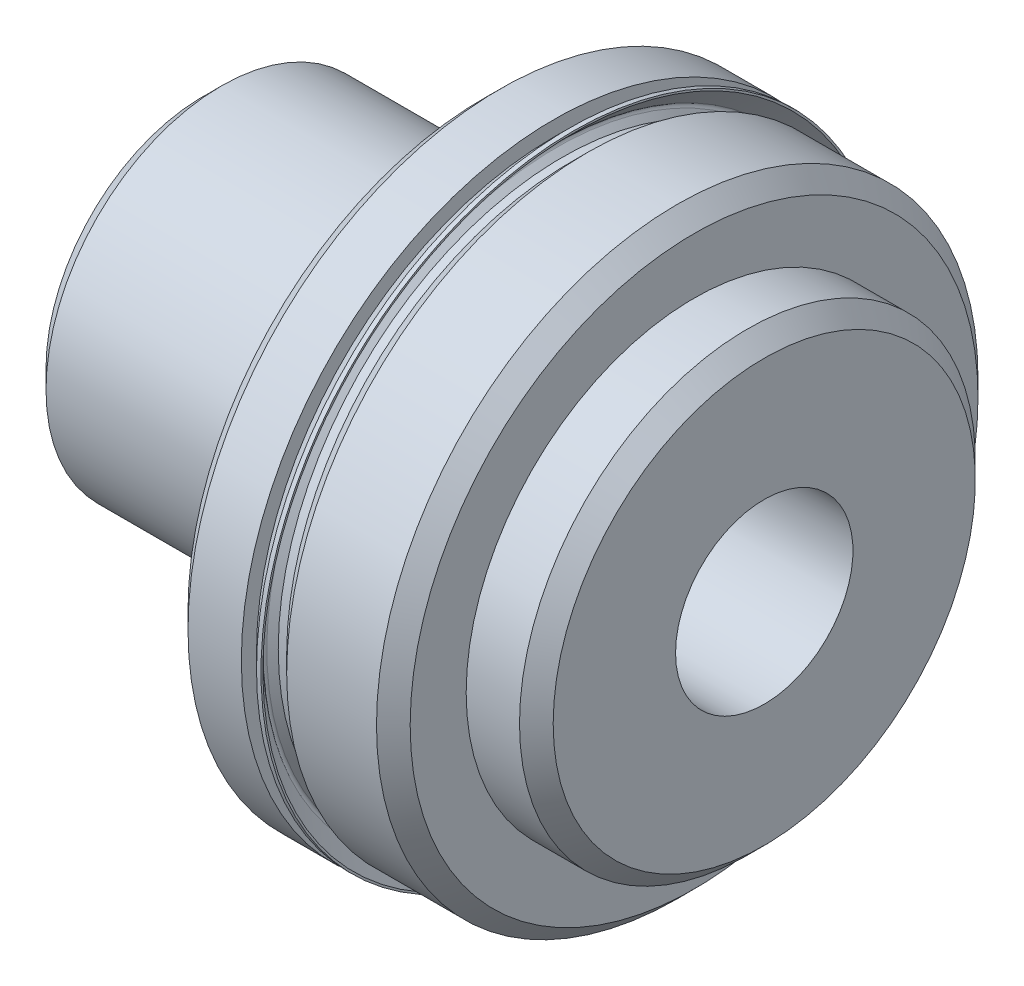
ISO-10303-21;
HEADER;
FILE_DESCRIPTION(('STEP AP214'),'2;1');
FILE_NAME('part.step','',(''),(''),'','','');
FILE_SCHEMA(('AUTOMOTIVE_DESIGN { 1 0 10303 214 1 1 1 1 }'));
ENDSEC;
DATA;
#1=APPLICATION_CONTEXT('core data for automotive mechanical design processes');
#2=APPLICATION_PROTOCOL_DEFINITION('international standard','automotive_design',2000,#1);
#3=PRODUCT_CONTEXT('',#1,'mechanical');
#4=PRODUCT('Part','Part','',(#3));
#5=PRODUCT_RELATED_PRODUCT_CATEGORY('part','',(#4));
#6=PRODUCT_DEFINITION_FORMATION('','',#4);
#7=PRODUCT_DEFINITION_CONTEXT('part definition',#1,'design');
#8=PRODUCT_DEFINITION('design','',#6,#7);
#9=PRODUCT_DEFINITION_SHAPE('','',#8);
#10=(LENGTH_UNIT() NAMED_UNIT(*) SI_UNIT(.MILLI.,.METRE.));
#11=(NAMED_UNIT(*) PLANE_ANGLE_UNIT() SI_UNIT($,.RADIAN.));
#12=(NAMED_UNIT(*) SI_UNIT($,.STERADIAN.) SOLID_ANGLE_UNIT());
#13=UNCERTAINTY_MEASURE_WITH_UNIT(LENGTH_MEASURE(1.E-05),#10,'distance_accuracy_value','');
#14=(GEOMETRIC_REPRESENTATION_CONTEXT(3) GLOBAL_UNCERTAINTY_ASSIGNED_CONTEXT((#13)) GLOBAL_UNIT_ASSIGNED_CONTEXT((#10,
#11,#12)) REPRESENTATION_CONTEXT('',''));
#15=CARTESIAN_POINT('',(0.,0.,0.));
#16=DIRECTION('',(0.,0.,1.));
#17=DIRECTION('',(1.,0.,0.));
#18=AXIS2_PLACEMENT_3D('',#15,#16,#17);
#19=CARTESIAN_POINT('',(15.875,14.1351,0.));
#20=DIRECTION('',(-1.,0.,0.));
#21=DIRECTION('',(0.,0.,1.));
#22=AXIS2_PLACEMENT_3D('',#19,#20,#21);
#23=PLANE('',#22);
#24=CARTESIAN_POINT('',(15.875,0.,0.));
#25=DIRECTION('',(-1.,0.,0.));
#26=DIRECTION('',(0.,0.,1.));
#27=AXIS2_PLACEMENT_3D('',#24,#25,#26);
#28=CIRCLE('',#27,14.1351);
#29=CARTESIAN_POINT('',(15.875,0.,14.1351));
#30=VERTEX_POINT('',#29);
#31=EDGE_CURVE('E69',#30,#30,#28,.T.);
#32=ORIENTED_EDGE('',*,*,#31,.F.);
#33=EDGE_LOOP('',(#32));
#34=FACE_BOUND('',#33,.T.);
#35=CARTESIAN_POINT('',(15.875,-3.67729204189182E-13,2.83395481766078E-13));
#36=DIRECTION('',(-1.,0.,0.));
#37=DIRECTION('',(0.,0.,1.));
#38=AXIS2_PLACEMENT_3D('',#35,#36,#37);
#39=CIRCLE('',#38,13.4490489304037);
#40=CARTESIAN_POINT('',(15.875,-3.67729204189182E-13,13.4490489304039));
#41=VERTEX_POINT('',#40);
#42=EDGE_CURVE('E10',#41,#41,#39,.F.);
#43=ORIENTED_EDGE('',*,*,#42,.F.);
#44=EDGE_LOOP('',(#43));
#45=FACE_BOUND('',#44,.T.);
#46=ADVANCED_FACE('F37',(#34,#45),#23,.F.);
#47=CARTESIAN_POINT('',(22.225,0.,0.));
#48=DIRECTION('',(-1.,0.,0.));
#49=DIRECTION('',(0.,0.,1.));
#50=AXIS2_PLACEMENT_3D('',#47,#48,#49);
#51=CYLINDRICAL_SURFACE('',#50,12.84605);
#52=CARTESIAN_POINT('',(16.637,0.,0.));
#53=DIRECTION('',(-1.,0.,0.));
#54=DIRECTION('',(0.,0.,1.));
#55=AXIS2_PLACEMENT_3D('',#52,#53,#54);
#56=CIRCLE('',#55,12.84605);
#57=CARTESIAN_POINT('',(16.637,0.,12.84605));
#58=VERTEX_POINT('',#57);
#59=EDGE_CURVE('E72',#58,#58,#56,.T.);
#60=ORIENTED_EDGE('',*,*,#59,.T.);
#61=EDGE_LOOP('',(#60));
#62=FACE_BOUND('',#61,.T.);
#63=CARTESIAN_POINT('',(16.2560000000001,-3.60955709766132E-13,0.));
#64=DIRECTION('',(-1.,0.,0.));
#65=DIRECTION('',(0.,-1.,0.));
#66=AXIS2_PLACEMENT_3D('',#63,#64,#65);
#67=CIRCLE('',#66,12.84605);
#68=CARTESIAN_POINT('',(16.2559999999998,-12.8460500000004,0.));
#69=VERTEX_POINT('',#68);
#70=EDGE_CURVE('E44',#69,#69,#67,.T.);
#71=ORIENTED_EDGE('',*,*,#70,.F.);
#72=EDGE_LOOP('',(#71));
#73=FACE_BOUND('',#72,.T.);
#74=ADVANCED_FACE('F127',(#62,#73),#51,.T.);
#75=CARTESIAN_POINT('',(22.225,12.84605,0.));
#76=DIRECTION('',(-1.,0.,0.));
#77=DIRECTION('',(0.,0.,1.));
#78=AXIS2_PLACEMENT_3D('',#75,#76,#77);
#79=PLANE('',#78);
#80=CARTESIAN_POINT('',(22.225,0.,0.));
#81=DIRECTION('',(-1.,0.,0.));
#82=DIRECTION('',(0.,0.,1.));
#83=AXIS2_PLACEMENT_3D('',#80,#81,#82);
#84=CIRCLE('',#83,12.84605);
#85=CARTESIAN_POINT('',(22.225,0.,12.84605));
#86=VERTEX_POINT('',#85);
#87=EDGE_CURVE('E81',#86,#86,#84,.T.);
#88=ORIENTED_EDGE('',*,*,#87,.F.);
#89=EDGE_LOOP('',(#88));
#90=FACE_BOUND('',#89,.T.);
#91=CARTESIAN_POINT('',(22.225,0.,0.));
#92=DIRECTION('',(-1.,0.,0.));
#93=DIRECTION('',(0.,0.,1.));
#94=AXIS2_PLACEMENT_3D('',#91,#92,#93);
#95=CIRCLE('',#94,10.3124);
#96=CARTESIAN_POINT('',(22.225,0.,10.3124));
#97=VERTEX_POINT('',#96);
#98=EDGE_CURVE('E48',#97,#97,#95,.F.);
#99=ORIENTED_EDGE('',*,*,#98,.F.);
#100=EDGE_LOOP('',(#99));
#101=FACE_BOUND('',#100,.T.);
#102=ADVANCED_FACE('F133',(#90,#101),#79,.F.);
#103=CARTESIAN_POINT('',(0.,0.,0.));
#104=DIRECTION('',(1.,0.,0.));
#105=DIRECTION('',(0.,0.,-1.));
#106=AXIS2_PLACEMENT_3D('',#103,#104,#105);
#107=PLANE('',#106);
#108=CARTESIAN_POINT('',(0.,0.,0.));
#109=DIRECTION('',(-1.,0.,0.));
#110=DIRECTION('',(0.,0.,1.));
#111=AXIS2_PLACEMENT_3D('',#108,#109,#110);
#112=CIRCLE('',#111,4.7752);
#113=CARTESIAN_POINT('',(0.,0.,4.7752));
#114=VERTEX_POINT('',#113);
#115=EDGE_CURVE('E96',#114,#114,#112,.T.);
#116=ORIENTED_EDGE('',*,*,#115,.F.);
#117=EDGE_LOOP('',(#116));
#118=FACE_BOUND('',#117,.T.);
#119=CARTESIAN_POINT('',(0.,0.,0.));
#120=DIRECTION('',(-1.,0.,0.));
#121=DIRECTION('',(0.,0.,1.));
#122=AXIS2_PLACEMENT_3D('',#119,#120,#121);
#123=CIRCLE('',#122,7.09803);
#124=CARTESIAN_POINT('',(0.,0.,7.09803));
#125=VERTEX_POINT('',#124);
#126=EDGE_CURVE('E52',#125,#125,#123,.T.);
#127=ORIENTED_EDGE('',*,*,#126,.T.);
#128=EDGE_LOOP('',(#127));
#129=FACE_BOUND('',#128,.T.);
#130=ADVANCED_FACE('F39',(#118,#129),#107,.F.);
#131=CARTESIAN_POINT('',(0.83947,0.,0.));
#132=DIRECTION('',(1.,0.,0.));
#133=DIRECTION('',(0.,0.,-1.));
#134=AXIS2_PLACEMENT_3D('',#131,#132,#133);
#135=CONICAL_SURFACE('',#134,7.9375,0.785398163397448);
#136=ORIENTED_EDGE('',*,*,#126,.F.);
#137=EDGE_LOOP('',(#136));
#138=FACE_BOUND('',#137,.T.);
#139=CARTESIAN_POINT('',(0.83947,0.,0.));
#140=DIRECTION('',(-1.,0.,0.));
#141=DIRECTION('',(0.,0.,1.));
#142=AXIS2_PLACEMENT_3D('',#139,#140,#141);
#143=CIRCLE('',#142,7.9375);
#144=CARTESIAN_POINT('',(0.83947,0.,7.9375));
#145=VERTEX_POINT('',#144);
#146=EDGE_CURVE('E57',#145,#145,#143,.T.);
#147=ORIENTED_EDGE('',*,*,#146,.T.);
#148=EDGE_LOOP('',(#147));
#149=FACE_BOUND('',#148,.T.);
#150=ADVANCED_FACE('F155',(#138,#149),#135,.T.);
#151=CARTESIAN_POINT('',(12.7,0.,0.));
#152=DIRECTION('',(-1.,0.,0.));
#153=DIRECTION('',(0.,0.,1.));
#154=AXIS2_PLACEMENT_3D('',#151,#152,#153);
#155=CYLINDRICAL_SURFACE('',#154,7.9375);
#156=ORIENTED_EDGE('',*,*,#146,.F.);
#157=EDGE_LOOP('',(#156));
#158=FACE_BOUND('',#157,.T.);
#159=CARTESIAN_POINT('',(12.7,0.,0.));
#160=DIRECTION('',(1.,0.,0.));
#161=DIRECTION('',(0.,0.,-1.));
#162=AXIS2_PLACEMENT_3D('',#159,#160,#161);
#163=CIRCLE('',#162,7.9375);
#164=CARTESIAN_POINT('',(12.7,0.,-7.9375));
#165=VERTEX_POINT('',#164);
#166=EDGE_CURVE('E60',#165,#165,#163,.T.);
#167=ORIENTED_EDGE('',*,*,#166,.F.);
#168=EDGE_LOOP('',(#167));
#169=FACE_BOUND('',#168,.T.);
#170=ADVANCED_FACE('F152',(#158,#169),#155,.T.);
#171=CARTESIAN_POINT('',(12.7,0.,0.));
#172=DIRECTION('',(1.,0.,0.));
#173=DIRECTION('',(0.,0.,-1.));
#174=AXIS2_PLACEMENT_3D('',#171,#172,#173);
#175=PLANE('',#174);
#176=CARTESIAN_POINT('',(12.7,0.,0.));
#177=DIRECTION('',(-1.,0.,0.));
#178=DIRECTION('',(0.,0.,1.));
#179=AXIS2_PLACEMENT_3D('',#176,#177,#178);
#180=CIRCLE('',#179,13.3731);
#181=CARTESIAN_POINT('',(12.7,0.,13.3731));
#182=VERTEX_POINT('',#181);
#183=EDGE_CURVE('E63',#182,#182,#180,.T.);
#184=ORIENTED_EDGE('',*,*,#183,.T.);
#185=EDGE_LOOP('',(#184));
#186=FACE_BOUND('',#185,.T.);
#187=ORIENTED_EDGE('',*,*,#166,.T.);
#188=EDGE_LOOP('',(#187));
#189=FACE_BOUND('',#188,.T.);
#190=ADVANCED_FACE('F148',(#186,#189),#175,.F.);
#191=CARTESIAN_POINT('',(13.462,0.,0.));
#192=DIRECTION('',(1.,0.,0.));
#193=DIRECTION('',(0.,0.,-1.));
#194=AXIS2_PLACEMENT_3D('',#191,#192,#193);
#195=CONICAL_SURFACE('',#194,14.1351,0.785398163397447);
#196=ORIENTED_EDGE('',*,*,#183,.F.);
#197=EDGE_LOOP('',(#196));
#198=FACE_BOUND('',#197,.T.);
#199=CARTESIAN_POINT('',(13.462,0.,0.));
#200=DIRECTION('',(-1.,0.,0.));
#201=DIRECTION('',(0.,0.,1.));
#202=AXIS2_PLACEMENT_3D('',#199,#200,#201);
#203=CIRCLE('',#202,14.1351);
#204=CARTESIAN_POINT('',(13.462,0.,14.1351));
#205=VERTEX_POINT('',#204);
#206=EDGE_CURVE('E66',#205,#205,#203,.T.);
#207=ORIENTED_EDGE('',*,*,#206,.T.);
#208=EDGE_LOOP('',(#207));
#209=FACE_BOUND('',#208,.T.);
#210=ADVANCED_FACE('F144',(#198,#209),#195,.T.);
#211=CARTESIAN_POINT('',(22.225,0.,0.));
#212=DIRECTION('',(-1.,0.,0.));
#213=DIRECTION('',(0.,0.,1.));
#214=AXIS2_PLACEMENT_3D('',#211,#212,#213);
#215=CYLINDRICAL_SURFACE('',#214,14.1351);
#216=ORIENTED_EDGE('',*,*,#206,.F.);
#217=EDGE_LOOP('',(#216));
#218=FACE_BOUND('',#217,.T.);
#219=ORIENTED_EDGE('',*,*,#31,.T.);
#220=EDGE_LOOP('',(#219));
#221=FACE_BOUND('',#220,.T.);
#222=ADVANCED_FACE('F140',(#218,#221),#215,.T.);
#223=CARTESIAN_POINT('',(17.399,0.,0.));
#224=DIRECTION('',(1.,0.,0.));
#225=DIRECTION('',(0.,0.,-1.));
#226=AXIS2_PLACEMENT_3D('',#223,#224,#225);
#227=CONICAL_SURFACE('',#226,13.60805,0.78539816339745);
#228=ORIENTED_EDGE('',*,*,#59,.F.);
#229=EDGE_LOOP('',(#228));
#230=FACE_BOUND('',#229,.T.);
#231=CARTESIAN_POINT('',(17.399,0.,0.));
#232=DIRECTION('',(-1.,0.,0.));
#233=DIRECTION('',(0.,0.,1.));
#234=AXIS2_PLACEMENT_3D('',#231,#232,#233);
#235=CIRCLE('',#234,13.60805);
#236=CARTESIAN_POINT('',(17.399,0.,13.60805));
#237=VERTEX_POINT('',#236);
#238=EDGE_CURVE('E75',#237,#237,#235,.T.);
#239=ORIENTED_EDGE('',*,*,#238,.T.);
#240=EDGE_LOOP('',(#239));
#241=FACE_BOUND('',#240,.T.);
#242=ADVANCED_FACE('F143',(#230,#241),#227,.T.);
#243=CARTESIAN_POINT('',(22.225,0.,0.));
#244=DIRECTION('',(-1.,0.,0.));
#245=DIRECTION('',(0.,0.,1.));
#246=AXIS2_PLACEMENT_3D('',#243,#244,#245);
#247=CYLINDRICAL_SURFACE('',#246,13.60805);
#248=ORIENTED_EDGE('',*,*,#238,.F.);
#249=EDGE_LOOP('',(#248));
#250=FACE_BOUND('',#249,.T.);
#251=CARTESIAN_POINT('',(21.463,0.,0.));
#252=DIRECTION('',(-1.,0.,0.));
#253=DIRECTION('',(0.,0.,1.));
#254=AXIS2_PLACEMENT_3D('',#251,#252,#253);
#255=CIRCLE('',#254,13.60805);
#256=CARTESIAN_POINT('',(21.463,0.,13.60805));
#257=VERTEX_POINT('',#256);
#258=EDGE_CURVE('E78',#257,#257,#255,.T.);
#259=ORIENTED_EDGE('',*,*,#258,.T.);
#260=EDGE_LOOP('',(#259));
#261=FACE_BOUND('',#260,.T.);
#262=ADVANCED_FACE('F209',(#250,#261),#247,.T.);
#263=CARTESIAN_POINT('',(22.225,0.,0.));
#264=DIRECTION('',(-1.,0.,0.));
#265=DIRECTION('',(0.,0.,1.));
#266=AXIS2_PLACEMENT_3D('',#263,#264,#265);
#267=CONICAL_SURFACE('',#266,12.84605,0.78539816339745);
#268=ORIENTED_EDGE('',*,*,#258,.F.);
#269=EDGE_LOOP('',(#268));
#270=FACE_BOUND('',#269,.T.);
#271=ORIENTED_EDGE('',*,*,#87,.T.);
#272=EDGE_LOOP('',(#271));
#273=FACE_BOUND('',#272,.T.);
#274=ADVANCED_FACE('F204',(#270,#273),#267,.T.);
#275=CARTESIAN_POINT('',(25.4,0.,0.));
#276=DIRECTION('',(-1.,0.,0.));
#277=DIRECTION('',(0.,0.,1.));
#278=AXIS2_PLACEMENT_3D('',#275,#276,#277);
#279=CYLINDRICAL_SURFACE('',#278,10.3124);
#280=ORIENTED_EDGE('',*,*,#98,.T.);
#281=EDGE_LOOP('',(#280));
#282=FACE_BOUND('',#281,.T.);
#283=CARTESIAN_POINT('',(24.638,0.,0.));
#284=DIRECTION('',(-1.,0.,0.));
#285=DIRECTION('',(0.,0.,1.));
#286=AXIS2_PLACEMENT_3D('',#283,#284,#285);
#287=CIRCLE('',#286,10.3124);
#288=CARTESIAN_POINT('',(24.638,0.,10.3124));
#289=VERTEX_POINT('',#288);
#290=EDGE_CURVE('E84',#289,#289,#287,.T.);
#291=ORIENTED_EDGE('',*,*,#290,.T.);
#292=EDGE_LOOP('',(#291));
#293=FACE_BOUND('',#292,.T.);
#294=ADVANCED_FACE('F201',(#282,#293),#279,.T.);
#295=CARTESIAN_POINT('',(25.4,0.,0.));
#296=DIRECTION('',(-1.,0.,0.));
#297=DIRECTION('',(0.,0.,1.));
#298=AXIS2_PLACEMENT_3D('',#295,#296,#297);
#299=CONICAL_SURFACE('',#298,9.5504,0.785398163397452);
#300=ORIENTED_EDGE('',*,*,#290,.F.);
#301=EDGE_LOOP('',(#300));
#302=FACE_BOUND('',#301,.T.);
#303=CARTESIAN_POINT('',(25.4,0.,0.));
#304=DIRECTION('',(-1.,0.,0.));
#305=DIRECTION('',(0.,0.,1.));
#306=AXIS2_PLACEMENT_3D('',#303,#304,#305);
#307=CIRCLE('',#306,9.5504);
#308=CARTESIAN_POINT('',(25.4,0.,9.5504));
#309=VERTEX_POINT('',#308);
#310=EDGE_CURVE('E87',#309,#309,#307,.T.);
#311=ORIENTED_EDGE('',*,*,#310,.T.);
#312=EDGE_LOOP('',(#311));
#313=FACE_BOUND('',#312,.T.);
#314=ADVANCED_FACE('F197',(#302,#313),#299,.T.);
#315=CARTESIAN_POINT('',(25.4,9.5504,0.));
#316=DIRECTION('',(-1.,0.,0.));
#317=DIRECTION('',(0.,0.,1.));
#318=AXIS2_PLACEMENT_3D('',#315,#316,#317);
#319=PLANE('',#318);
#320=CARTESIAN_POINT('',(25.4,0.,0.));
#321=DIRECTION('',(-1.,0.,0.));
#322=DIRECTION('',(0.,0.,1.));
#323=AXIS2_PLACEMENT_3D('',#320,#321,#322);
#324=CIRCLE('',#323,4.0132);
#325=CARTESIAN_POINT('',(25.4,0.,4.0132));
#326=VERTEX_POINT('',#325);
#327=EDGE_CURVE('E90',#326,#326,#324,.T.);
#328=ORIENTED_EDGE('',*,*,#327,.T.);
#329=EDGE_LOOP('',(#328));
#330=FACE_BOUND('',#329,.T.);
#331=ORIENTED_EDGE('',*,*,#310,.F.);
#332=EDGE_LOOP('',(#331));
#333=FACE_BOUND('',#332,.T.);
#334=ADVANCED_FACE('F189',(#330,#333),#319,.F.);
#335=CARTESIAN_POINT('',(0.,0.,0.));
#336=DIRECTION('',(-1.,0.,0.));
#337=DIRECTION('',(0.,0.,1.));
#338=AXIS2_PLACEMENT_3D('',#335,#336,#337);
#339=CYLINDRICAL_SURFACE('',#338,4.0132);
#340=ORIENTED_EDGE('',*,*,#327,.F.);
#341=EDGE_LOOP('',(#340));
#342=FACE_BOUND('',#341,.T.);
#343=CARTESIAN_POINT('',(0.761999999999992,0.,0.));
#344=DIRECTION('',(-1.,0.,0.));
#345=DIRECTION('',(0.,0.,1.));
#346=AXIS2_PLACEMENT_3D('',#343,#344,#345);
#347=CIRCLE('',#346,4.0132);
#348=CARTESIAN_POINT('',(0.761999999999992,0.,4.0132));
#349=VERTEX_POINT('',#348);
#350=EDGE_CURVE('E93',#349,#349,#347,.T.);
#351=ORIENTED_EDGE('',*,*,#350,.T.);
#352=EDGE_LOOP('',(#351));
#353=FACE_BOUND('',#352,.T.);
#354=ADVANCED_FACE('F180',(#342,#353),#339,.F.);
#355=CARTESIAN_POINT('',(0.,0.,0.));
#356=DIRECTION('',(-1.,0.,0.));
#357=DIRECTION('',(0.,0.,1.));
#358=AXIS2_PLACEMENT_3D('',#355,#356,#357);
#359=CONICAL_SURFACE('',#358,4.7752,0.78539816339745);
#360=ORIENTED_EDGE('',*,*,#350,.F.);
#361=EDGE_LOOP('',(#360));
#362=FACE_BOUND('',#361,.T.);
#363=ORIENTED_EDGE('',*,*,#115,.T.);
#364=EDGE_LOOP('',(#363));
#365=FACE_BOUND('',#364,.T.);
#366=ADVANCED_FACE('F177',(#362,#365),#359,.F.);
#367=CARTESIAN_POINT('',(16.5610510695967,-3.67729204189182E-13,0.));
#368=DIRECTION('',(1.,0.,0.));
#369=DIRECTION('',(0.,1.,0.));
#370=AXIS2_PLACEMENT_3D('',#367,#368,#369);
#371=CONICAL_SURFACE('',#370,14.1351000000004,0.78539816339747);
#372=ORIENTED_EDGE('',*,*,#42,.T.);
#373=EDGE_LOOP('',(#372));
#374=FACE_BOUND('',#373,.T.);
#375=CARTESIAN_POINT('',(16.5610510695967,-3.67729204189182E-13,0.));
#376=DIRECTION('',(-1.,0.,0.));
#377=DIRECTION('',(0.,-1.,0.));
#378=AXIS2_PLACEMENT_3D('',#375,#376,#377);
#379=CIRCLE('',#378,14.1351000000004);
#380=CARTESIAN_POINT('',(16.5610510695964,-14.1351000000007,0.));
#381=VERTEX_POINT('',#380);
#382=EDGE_CURVE('E99',#381,#381,#379,.T.);
#383=ORIENTED_EDGE('',*,*,#382,.T.);
#384=EDGE_LOOP('',(#383));
#385=FACE_BOUND('',#384,.T.);
#386=ADVANCED_FACE('F179',(#374,#385),#371,.T.);
#387=CARTESIAN_POINT('',(16.637,-3.6941560921377E-13,0.));
#388=DIRECTION('',(-1.,0.,0.));
#389=DIRECTION('',(0.,-1.,0.));
#390=AXIS2_PLACEMENT_3D('',#387,#388,#389);
#391=CYLINDRICAL_SURFACE('',#390,14.1351000000004);
#392=ORIENTED_EDGE('',*,*,#382,.F.);
#393=EDGE_LOOP('',(#392));
#394=FACE_BOUND('',#393,.T.);
#395=CARTESIAN_POINT('',(16.7642510695972,-3.72241150561268E-13,0.));
#396=DIRECTION('',(-1.,0.,0.));
#397=DIRECTION('',(0.,-1.,0.));
#398=AXIS2_PLACEMENT_3D('',#395,#396,#397);
#399=CIRCLE('',#398,14.1351000000004);
#400=CARTESIAN_POINT('',(16.7642510695969,-14.1351000000007,0.));
#401=VERTEX_POINT('',#400);
#402=EDGE_CURVE('E102',#401,#401,#399,.T.);
#403=ORIENTED_EDGE('',*,*,#402,.T.);
#404=EDGE_LOOP('',(#403));
#405=FACE_BOUND('',#404,.T.);
#406=ADVANCED_FACE('F187',(#394,#405),#391,.T.);
#407=CARTESIAN_POINT('',(16.7642510695975,14.0509318041255,0.));
#408=DIRECTION('',(-1.,0.,0.));
#409=DIRECTION('',(0.,-1.,0.));
#410=AXIS2_PLACEMENT_3D('',#407,#408,#409);
#411=PLANE('',#410);
#412=ORIENTED_EDGE('',*,*,#402,.F.);
#413=EDGE_LOOP('',(#412));
#414=FACE_BOUND('',#413,.T.);
#415=CARTESIAN_POINT('',(16.7642510695972,-3.72241150561268E-13,0.));
#416=DIRECTION('',(-1.,0.,0.));
#417=DIRECTION('',(0.,-1.,0.));
#418=AXIS2_PLACEMENT_3D('',#415,#416,#417);
#419=CIRCLE('',#418,14.0509318041259);
#420=CARTESIAN_POINT('',(16.7642510695969,-14.0509318041262,0.));
#421=VERTEX_POINT('',#420);
#422=EDGE_CURVE('E105',#421,#421,#419,.T.);
#423=ORIENTED_EDGE('',*,*,#422,.T.);
#424=EDGE_LOOP('',(#423));
#425=FACE_BOUND('',#424,.T.);
#426=ADVANCED_FACE('F277',(#414,#425),#411,.F.);
#427=CARTESIAN_POINT('',(15.9974871939457,-3.55215572377294E-13,0.));
#428=DIRECTION('',(1.,0.,0.));
#429=DIRECTION('',(0.,1.,0.));
#430=AXIS2_PLACEMENT_3D('',#427,#428,#429);
#431=CONICAL_SURFACE('',#430,13.2841679284744,0.78539816339747);
#432=ORIENTED_EDGE('',*,*,#422,.F.);
#433=EDGE_LOOP('',(#432));
#434=FACE_BOUND('',#433,.T.);
#435=CARTESIAN_POINT('',(15.9974871939457,-3.55215572377294E-13,0.));
#436=DIRECTION('',(-1.,0.,0.));
#437=DIRECTION('',(0.,-1.,0.));
#438=AXIS2_PLACEMENT_3D('',#435,#436,#437);
#439=CIRCLE('',#438,13.2841679284744);
#440=CARTESIAN_POINT('',(15.9974871939454,-13.2841679284747,0.));
#441=VERTEX_POINT('',#440);
#442=EDGE_CURVE('E108',#441,#441,#439,.T.);
#443=ORIENTED_EDGE('',*,*,#442,.T.);
#444=EDGE_LOOP('',(#443));
#445=FACE_BOUND('',#444,.T.);
#446=ADVANCED_FACE('F123',(#434,#445),#431,.F.);
#447=CARTESIAN_POINT('',(16.0872897551558,-3.57353036051222E-13,0.));
#448=DIRECTION('',(-1.,0.,0.));
#449=DIRECTION('',(0.,-1.,0.));
#450=AXIS2_PLACEMENT_3D('',#447,#448,#449);
#451=TOROIDAL_SURFACE('',#450,13.1943653672644,0.126999999999067);
#452=ORIENTED_EDGE('',*,*,#442,.F.);
#453=EDGE_LOOP('',(#452));
#454=FACE_BOUND('',#453,.T.);
#455=CARTESIAN_POINT('',(15.9974871939457,-3.55215572377295E-13,0.));
#456=DIRECTION('',(-1.,0.,0.));
#457=DIRECTION('',(0.,-1.,0.));
#458=AXIS2_PLACEMENT_3D('',#455,#456,#457);
#459=CIRCLE('',#458,13.1045628060543);
#460=CARTESIAN_POINT('',(15.9974871939454,-13.1045628060547,0.));
#461=VERTEX_POINT('',#460);
#462=EDGE_CURVE('E111',#461,#461,#459,.T.);
#463=ORIENTED_EDGE('',*,*,#462,.T.);
#464=EDGE_LOOP('',(#463));
#465=FACE_BOUND('',#464,.T.);
#466=ADVANCED_FACE('F115',(#454,#465),#451,.F.);
#467=CARTESIAN_POINT('',(16.2559999999997,-3.60955709766124E-13,0.));
#468=DIRECTION('',(-1.,0.,0.));
#469=DIRECTION('',(0.,-1.,0.));
#470=AXIS2_PLACEMENT_3D('',#467,#468,#469);
#471=CONICAL_SURFACE('',#470,12.8460500000004,0.785398163397425);
#472=ORIENTED_EDGE('',*,*,#462,.F.);
#473=EDGE_LOOP('',(#472));
#474=FACE_BOUND('',#473,.T.);
#475=ORIENTED_EDGE('',*,*,#70,.T.);
#476=EDGE_LOOP('',(#475));
#477=FACE_BOUND('',#476,.T.);
#478=ADVANCED_FACE('F117',(#474,#477),#471,.T.);
#479=CLOSED_SHELL('',(#46,#74,#102,#130,#150,#170,#190,#210,#222,#242,#262,#274,#294,#314,#334,
#354,#366,#386,#406,#426,#446,#466,#478));
#480=MANIFOLD_SOLID_BREP('B2',#479);
#481=ADVANCED_BREP_SHAPE_REPRESENTATION('',(#18,#480),#14);
#482=SHAPE_DEFINITION_REPRESENTATION(#9,#481);
ENDSEC;
END-ISO-10303-21;
